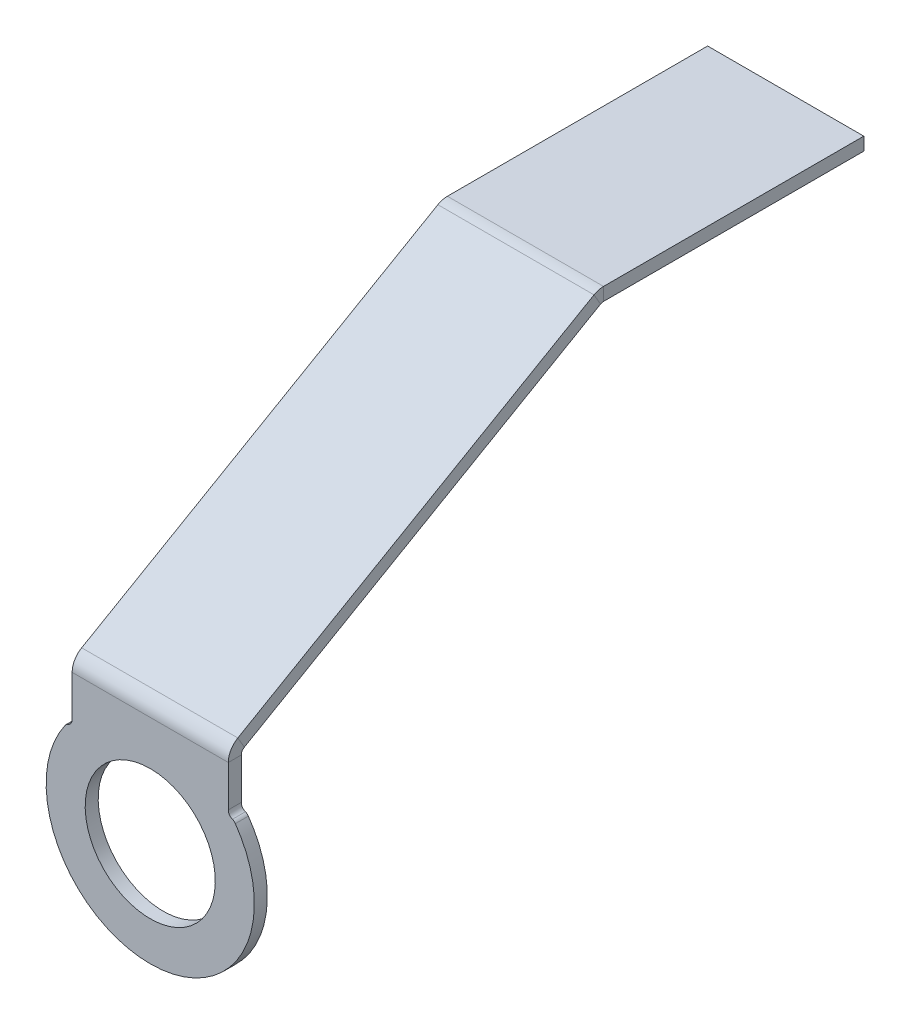
ISO-10303-21;
HEADER;
FILE_DESCRIPTION(('STEP AP214'),'2;1');
FILE_NAME('part.step','',(''),(''),'','','');
FILE_SCHEMA(('AUTOMOTIVE_DESIGN { 1 0 10303 214 1 1 1 1 }'));
ENDSEC;
DATA;
#1=APPLICATION_CONTEXT('core data for automotive mechanical design processes');
#2=APPLICATION_PROTOCOL_DEFINITION('international standard','automotive_design',2000,#1);
#3=PRODUCT_CONTEXT('',#1,'mechanical');
#4=PRODUCT('Part','Part','',(#3));
#5=PRODUCT_RELATED_PRODUCT_CATEGORY('part','',(#4));
#6=PRODUCT_DEFINITION_FORMATION('','',#4);
#7=PRODUCT_DEFINITION_CONTEXT('part definition',#1,'design');
#8=PRODUCT_DEFINITION('design','',#6,#7);
#9=PRODUCT_DEFINITION_SHAPE('','',#8);
#10=(LENGTH_UNIT() NAMED_UNIT(*) SI_UNIT(.MILLI.,.METRE.));
#11=(NAMED_UNIT(*) PLANE_ANGLE_UNIT() SI_UNIT($,.RADIAN.));
#12=(NAMED_UNIT(*) SI_UNIT($,.STERADIAN.) SOLID_ANGLE_UNIT());
#13=UNCERTAINTY_MEASURE_WITH_UNIT(LENGTH_MEASURE(1.E-05),#10,'distance_accuracy_value','');
#14=(GEOMETRIC_REPRESENTATION_CONTEXT(3) GLOBAL_UNCERTAINTY_ASSIGNED_CONTEXT((#13)) GLOBAL_UNIT_ASSIGNED_CONTEXT((#10,
#11,#12)) REPRESENTATION_CONTEXT('',''));
#15=CARTESIAN_POINT('',(0.,0.,0.));
#16=DIRECTION('',(0.,0.,1.));
#17=DIRECTION('',(1.,0.,0.));
#18=AXIS2_PLACEMENT_3D('',#15,#16,#17);
#19=CARTESIAN_POINT('',(9.525,-1.5875,-15.875));
#20=DIRECTION('',(1.,0.,0.));
#21=DIRECTION('',(0.,0.,-1.));
#22=AXIS2_PLACEMENT_3D('',#19,#20,#21);
#23=PLANE('',#22);
#24=DIRECTION('',(0.,0.,-1.));
#25=VECTOR('',#24,1.);
#26=CARTESIAN_POINT('',(9.525,0.,-15.875));
#27=LINE('',#26,#25);
#28=CARTESIAN_POINT('',(9.525,0.,15.875));
#29=VERTEX_POINT('',#28);
#30=CARTESIAN_POINT('',(9.525,0.,-15.875));
#31=VERTEX_POINT('',#30);
#32=EDGE_CURVE('E121',#29,#31,#27,.T.);
#33=ORIENTED_EDGE('',*,*,#32,.F.);
#34=DIRECTION('',(0.,1.,0.));
#35=VECTOR('',#34,1.);
#36=CARTESIAN_POINT('',(9.525,-1.5875,15.875));
#37=LINE('',#36,#35);
#38=CARTESIAN_POINT('',(9.525,-1.5875,15.875));
#39=VERTEX_POINT('',#38);
#40=EDGE_CURVE('E13',#39,#29,#37,.T.);
#41=ORIENTED_EDGE('',*,*,#40,.F.);
#42=DIRECTION('',(0.,0.,-1.));
#43=VECTOR('',#42,1.);
#44=CARTESIAN_POINT('',(9.525,-1.5875,-15.875));
#45=LINE('',#44,#43);
#46=CARTESIAN_POINT('',(9.525,-1.5875,-15.875));
#47=VERTEX_POINT('',#46);
#48=EDGE_CURVE('E142',#39,#47,#45,.T.);
#49=ORIENTED_EDGE('',*,*,#48,.T.);
#50=DIRECTION('',(0.,1.,0.));
#51=VECTOR('',#50,1.);
#52=CARTESIAN_POINT('',(9.525,-1.5875,-15.875));
#53=LINE('',#52,#51);
#54=EDGE_CURVE('E76',#47,#31,#53,.T.);
#55=ORIENTED_EDGE('',*,*,#54,.T.);
#56=EDGE_LOOP('',(#33,#41,#49,#55));
#57=FACE_BOUND('',#56,.T.);
#58=ADVANCED_FACE('F73',(#57),#23,.T.);
#59=CARTESIAN_POINT('',(-9.525,-1.5875,15.875));
#60=DIRECTION('',(-1.,0.,0.));
#61=DIRECTION('',(0.,0.,1.));
#62=AXIS2_PLACEMENT_3D('',#59,#60,#61);
#63=PLANE('',#62);
#64=DIRECTION('',(0.,0.,1.));
#65=VECTOR('',#64,1.);
#66=CARTESIAN_POINT('',(-9.525,0.,15.875));
#67=LINE('',#66,#65);
#68=CARTESIAN_POINT('',(-9.525,0.,-15.875));
#69=VERTEX_POINT('',#68);
#70=CARTESIAN_POINT('',(-9.525,0.,15.875));
#71=VERTEX_POINT('',#70);
#72=EDGE_CURVE('E141',#69,#71,#67,.T.);
#73=ORIENTED_EDGE('',*,*,#72,.F.);
#74=DIRECTION('',(0.,1.,0.));
#75=VECTOR('',#74,1.);
#76=CARTESIAN_POINT('',(-9.525,-1.5875,-15.875));
#77=LINE('',#76,#75);
#78=CARTESIAN_POINT('',(-9.525,-1.5875,-15.875));
#79=VERTEX_POINT('',#78);
#80=EDGE_CURVE('E91',#79,#69,#77,.T.);
#81=ORIENTED_EDGE('',*,*,#80,.F.);
#82=DIRECTION('',(0.,0.,1.));
#83=VECTOR('',#82,1.);
#84=CARTESIAN_POINT('',(-9.525,-1.5875,15.875));
#85=LINE('',#84,#83);
#86=CARTESIAN_POINT('',(-9.525,-1.58750000000001,15.875));
#87=VERTEX_POINT('',#86);
#88=EDGE_CURVE('E152',#79,#87,#85,.T.);
#89=ORIENTED_EDGE('',*,*,#88,.T.);
#90=DIRECTION('',(0.,1.,0.));
#91=VECTOR('',#90,1.);
#92=CARTESIAN_POINT('',(-9.525,-1.5875,15.875));
#93=LINE('',#92,#91);
#94=EDGE_CURVE('E82',#87,#71,#93,.T.);
#95=ORIENTED_EDGE('',*,*,#94,.T.);
#96=EDGE_LOOP('',(#73,#81,#89,#95));
#97=FACE_BOUND('',#96,.T.);
#98=ADVANCED_FACE('F319',(#97),#63,.T.);
#99=CARTESIAN_POINT('',(-9.525,-1.5875,-15.875));
#100=DIRECTION('',(0.,0.,-1.));
#101=DIRECTION('',(-1.,0.,0.));
#102=AXIS2_PLACEMENT_3D('',#99,#100,#101);
#103=PLANE('',#102);
#104=DIRECTION('',(-1.,0.,0.));
#105=VECTOR('',#104,1.);
#106=CARTESIAN_POINT('',(-9.525,0.,-15.875));
#107=LINE('',#106,#105);
#108=EDGE_CURVE('E137',#31,#69,#107,.T.);
#109=ORIENTED_EDGE('',*,*,#108,.F.);
#110=ORIENTED_EDGE('',*,*,#54,.F.);
#111=DIRECTION('',(-1.,0.,0.));
#112=VECTOR('',#111,1.);
#113=CARTESIAN_POINT('',(-9.525,-1.5875,-15.875));
#114=LINE('',#113,#112);
#115=EDGE_CURVE('E144',#47,#79,#114,.T.);
#116=ORIENTED_EDGE('',*,*,#115,.T.);
#117=ORIENTED_EDGE('',*,*,#80,.T.);
#118=EDGE_LOOP('',(#109,#110,#116,#117));
#119=FACE_BOUND('',#118,.T.);
#120=ADVANCED_FACE('F159',(#119),#103,.T.);
#121=CARTESIAN_POINT('',(9.525,-1.5875,15.875));
#122=DIRECTION('',(0.,-1.,0.));
#123=DIRECTION('',(0.,0.,-1.));
#124=AXIS2_PLACEMENT_3D('',#121,#122,#123);
#125=PLANE('',#124);
#126=ORIENTED_EDGE('',*,*,#48,.F.);
#127=DIRECTION('',(1.,0.,0.));
#128=VECTOR('',#127,1.);
#129=CARTESIAN_POINT('',(9.525,-1.5875,15.875));
#130=LINE('',#129,#128);
#131=EDGE_CURVE('E150',#87,#39,#130,.T.);
#132=ORIENTED_EDGE('',*,*,#131,.F.);
#133=ORIENTED_EDGE('',*,*,#88,.F.);
#134=ORIENTED_EDGE('',*,*,#115,.F.);
#135=EDGE_LOOP('',(#126,#132,#133,#134));
#136=FACE_BOUND('',#135,.T.);
#137=ADVANCED_FACE('F162',(#136),#125,.T.);
#138=CARTESIAN_POINT('',(9.525,0.,15.875));
#139=DIRECTION('',(0.,-1.,0.));
#140=DIRECTION('',(0.,0.,-1.));
#141=AXIS2_PLACEMENT_3D('',#138,#139,#140);
#142=PLANE('',#141);
#143=ORIENTED_EDGE('',*,*,#32,.T.);
#144=ORIENTED_EDGE('',*,*,#108,.T.);
#145=ORIENTED_EDGE('',*,*,#72,.T.);
#146=DIRECTION('',(1.,0.,0.));
#147=VECTOR('',#146,1.);
#148=CARTESIAN_POINT('',(9.525,0.,15.875));
#149=LINE('',#148,#147);
#150=EDGE_CURVE('E113',#71,#29,#149,.T.);
#151=ORIENTED_EDGE('',*,*,#150,.T.);
#152=EDGE_LOOP('',(#143,#144,#145,#151));
#153=FACE_BOUND('',#152,.T.);
#154=ADVANCED_FACE('F140',(#153),#142,.F.);
#155=CARTESIAN_POINT('',(9.525,-2.32410000000001,15.875));
#156=DIRECTION('',(1.,0.,0.));
#157=DIRECTION('',(0.,1.,0.));
#158=AXIS2_PLACEMENT_3D('',#155,#156,#157);
#159=PLANE('',#158);
#160=DIRECTION('',(0.,-0.866025403784442,-0.499999999999995));
#161=VECTOR('',#160,1.);
#162=CARTESIAN_POINT('',(9.525,-0.311370359064582,17.03705));
#163=LINE('',#162,#161);
#164=CARTESIAN_POINT('',(9.525,-1.68618568757238,16.2433));
#165=VERTEX_POINT('',#164);
#166=CARTESIAN_POINT('',(9.525,-0.311370359064585,17.03705));
#167=VERTEX_POINT('',#166);
#168=EDGE_CURVE('E169',#165,#167,#163,.F.);
#169=ORIENTED_EDGE('',*,*,#168,.F.);
#170=CARTESIAN_POINT('',(9.525,-2.32410000000001,15.875));
#171=DIRECTION('',(-1.,0.,0.));
#172=DIRECTION('',(0.,-1.,0.));
#173=AXIS2_PLACEMENT_3D('',#170,#171,#172);
#174=CIRCLE('',#173,0.736600000000009);
#175=EDGE_CURVE('E130',#39,#165,#174,.F.);
#176=ORIENTED_EDGE('',*,*,#175,.F.);
#177=ORIENTED_EDGE('',*,*,#40,.T.);
#178=CARTESIAN_POINT('',(9.525,-2.32410000000001,15.875));
#179=DIRECTION('',(-1.,0.,0.));
#180=DIRECTION('',(0.,-1.,0.));
#181=AXIS2_PLACEMENT_3D('',#178,#179,#180);
#182=CIRCLE('',#181,2.32410000000001);
#183=EDGE_CURVE('E109',#29,#167,#182,.F.);
#184=ORIENTED_EDGE('',*,*,#183,.T.);
#185=EDGE_LOOP('',(#169,#176,#177,#184));
#186=FACE_BOUND('',#185,.T.);
#187=ADVANCED_FACE('F127',(#186),#159,.T.);
#188=CARTESIAN_POINT('',(-9.525,-2.32410000000002,15.875));
#189=DIRECTION('',(1.,0.,0.));
#190=DIRECTION('',(0.,1.,0.));
#191=AXIS2_PLACEMENT_3D('',#188,#189,#190);
#192=PLANE('',#191);
#193=CARTESIAN_POINT('',(-9.525,-2.32410000000002,15.875));
#194=DIRECTION('',(-1.,0.,0.));
#195=DIRECTION('',(0.,-1.,0.));
#196=AXIS2_PLACEMENT_3D('',#193,#194,#195);
#197=CIRCLE('',#196,0.736600000000009);
#198=CARTESIAN_POINT('',(-9.525,-1.68618568757239,16.2433));
#199=VERTEX_POINT('',#198);
#200=EDGE_CURVE('E164',#199,#87,#197,.T.);
#201=ORIENTED_EDGE('',*,*,#200,.F.);
#202=DIRECTION('',(0.,-0.866025403784442,-0.499999999999995));
#203=VECTOR('',#202,1.);
#204=CARTESIAN_POINT('',(-9.525,-1.68618568757238,16.2433));
#205=LINE('',#204,#203);
#206=CARTESIAN_POINT('',(-9.525,-0.311370359064582,17.03705));
#207=VERTEX_POINT('',#206);
#208=EDGE_CURVE('E175',#199,#207,#205,.F.);
#209=ORIENTED_EDGE('',*,*,#208,.T.);
#210=CARTESIAN_POINT('',(-9.525,-2.32410000000002,15.875));
#211=DIRECTION('',(-1.,0.,0.));
#212=DIRECTION('',(0.,-1.,0.));
#213=AXIS2_PLACEMENT_3D('',#210,#211,#212);
#214=CIRCLE('',#213,2.32410000000001);
#215=EDGE_CURVE('E122',#207,#71,#214,.T.);
#216=ORIENTED_EDGE('',*,*,#215,.T.);
#217=ORIENTED_EDGE('',*,*,#94,.F.);
#218=EDGE_LOOP('',(#201,#209,#216,#217));
#219=FACE_BOUND('',#218,.T.);
#220=ADVANCED_FACE('F332',(#219),#192,.F.);
#221=CARTESIAN_POINT('',(-9.525,-2.32410000000002,15.875));
#222=DIRECTION('',(-1.,0.,0.));
#223=DIRECTION('',(0.,0.866025403784442,0.499999999999995));
#224=AXIS2_PLACEMENT_3D('',#221,#222,#223);
#225=CYLINDRICAL_SURFACE('',#224,2.32410000000001);
#226=ORIENTED_EDGE('',*,*,#150,.F.);
#227=ORIENTED_EDGE('',*,*,#215,.F.);
#228=DIRECTION('',(-1.,0.,0.));
#229=VECTOR('',#228,1.);
#230=CARTESIAN_POINT('',(9.525,-0.311370359064582,17.03705));
#231=LINE('',#230,#229);
#232=EDGE_CURVE('E117',#207,#167,#231,.F.);
#233=ORIENTED_EDGE('',*,*,#232,.T.);
#234=ORIENTED_EDGE('',*,*,#183,.F.);
#235=EDGE_LOOP('',(#226,#227,#233,#234));
#236=FACE_BOUND('',#235,.T.);
#237=ADVANCED_FACE('F110',(#236),#225,.T.);
#238=CARTESIAN_POINT('',(-9.525,-2.32410000000002,15.875));
#239=DIRECTION('',(-1.,0.,0.));
#240=DIRECTION('',(0.,0.866025403784442,0.499999999999995));
#241=AXIS2_PLACEMENT_3D('',#238,#239,#240);
#242=CYLINDRICAL_SURFACE('',#241,0.736600000000009);
#243=ORIENTED_EDGE('',*,*,#131,.T.);
#244=ORIENTED_EDGE('',*,*,#175,.T.);
#245=DIRECTION('',(-1.,0.,0.));
#246=VECTOR('',#245,1.);
#247=CARTESIAN_POINT('',(9.525,-1.68618568757238,16.2433));
#248=LINE('',#247,#246);
#249=EDGE_CURVE('E171',#165,#199,#248,.T.);
#250=ORIENTED_EDGE('',*,*,#249,.T.);
#251=ORIENTED_EDGE('',*,*,#200,.T.);
#252=EDGE_LOOP('',(#243,#244,#250,#251));
#253=FACE_BOUND('',#252,.T.);
#254=ADVANCED_FACE('F336',(#253),#242,.F.);
#255=CARTESIAN_POINT('',(-9.525,-25.3999999999997,60.4918312303788));
#256=DIRECTION('',(1.,0.,0.));
#257=DIRECTION('',(0.,0.,-1.));
#258=AXIS2_PLACEMENT_3D('',#255,#256,#257);
#259=PLANE('',#258);
#260=ORIENTED_EDGE('',*,*,#208,.F.);
#261=DIRECTION('',(0.,0.499999999999995,-0.866025403784442));
#262=VECTOR('',#261,1.);
#263=CARTESIAN_POINT('',(-9.525,-26.7748153285075,59.6980812303788));
#264=LINE('',#263,#262);
#265=CARTESIAN_POINT('',(-9.525,-26.7748153285075,59.6980812303788));
#266=VERTEX_POINT('',#265);
#267=EDGE_CURVE('E179',#199,#266,#264,.F.);
#268=ORIENTED_EDGE('',*,*,#267,.T.);
#269=DIRECTION('',(0.,-0.866025403784442,-0.499999999999995));
#270=VECTOR('',#269,1.);
#271=CARTESIAN_POINT('',(-9.525,-25.3999999999997,60.4918312303788));
#272=LINE('',#271,#270);
#273=CARTESIAN_POINT('',(-9.525,-25.3999999999997,60.4918312303788));
#274=VERTEX_POINT('',#273);
#275=EDGE_CURVE('E166',#274,#266,#272,.T.);
#276=ORIENTED_EDGE('',*,*,#275,.F.);
#277=DIRECTION('',(0.,-0.499999999999995,0.866025403784442));
#278=VECTOR('',#277,1.);
#279=CARTESIAN_POINT('',(-9.525,-0.2126846714922,16.8661213751448));
#280=LINE('',#279,#278);
#281=EDGE_CURVE('E188',#207,#274,#280,.T.);
#282=ORIENTED_EDGE('',*,*,#281,.F.);
#283=EDGE_LOOP('',(#260,#268,#276,#282));
#284=FACE_BOUND('',#283,.T.);
#285=ADVANCED_FACE('F341',(#284),#259,.F.);
#286=CARTESIAN_POINT('',(9.525,-0.2126846714922,16.8661213751448));
#287=DIRECTION('',(-1.,0.,0.));
#288=DIRECTION('',(0.,0.,1.));
#289=AXIS2_PLACEMENT_3D('',#286,#287,#288);
#290=PLANE('',#289);
#291=ORIENTED_EDGE('',*,*,#168,.T.);
#292=DIRECTION('',(0.,0.499999999999995,-0.866025403784442));
#293=VECTOR('',#292,1.);
#294=CARTESIAN_POINT('',(9.525,-0.2126846714922,16.8661213751448));
#295=LINE('',#294,#293);
#296=CARTESIAN_POINT('',(9.525,-25.3999999999997,60.4918312303788));
#297=VERTEX_POINT('',#296);
#298=EDGE_CURVE('E194',#297,#167,#295,.T.);
#299=ORIENTED_EDGE('',*,*,#298,.F.);
#300=DIRECTION('',(0.,-0.866025403784442,-0.499999999999995));
#301=VECTOR('',#300,1.);
#302=CARTESIAN_POINT('',(9.525,-25.3999999999997,60.4918312303788));
#303=LINE('',#302,#301);
#304=CARTESIAN_POINT('',(9.525,-26.7748153285075,59.6980812303788));
#305=VERTEX_POINT('',#304);
#306=EDGE_CURVE('E197',#297,#305,#303,.T.);
#307=ORIENTED_EDGE('',*,*,#306,.T.);
#308=DIRECTION('',(0.,-0.499999999999995,0.866025403784442));
#309=VECTOR('',#308,1.);
#310=CARTESIAN_POINT('',(9.525,-1.5875,16.0723713751448));
#311=LINE('',#310,#309);
#312=EDGE_CURVE('E185',#305,#165,#311,.F.);
#313=ORIENTED_EDGE('',*,*,#312,.T.);
#314=EDGE_LOOP('',(#291,#299,#307,#313));
#315=FACE_BOUND('',#314,.T.);
#316=ADVANCED_FACE('F346',(#315),#290,.F.);
#317=CARTESIAN_POINT('',(-9.525,-0.2126846714922,16.8661213751448));
#318=DIRECTION('',(0.,-0.866025403784442,-0.499999999999995));
#319=DIRECTION('',(0.,0.499999999999995,-0.866025403784442));
#320=AXIS2_PLACEMENT_3D('',#317,#318,#319);
#321=PLANE('',#320);
#322=ORIENTED_EDGE('',*,*,#232,.F.);
#323=ORIENTED_EDGE('',*,*,#281,.T.);
#324=DIRECTION('',(1.,0.,0.));
#325=VECTOR('',#324,1.);
#326=CARTESIAN_POINT('',(-9.525,-25.3999999999997,60.4918312303788));
#327=LINE('',#326,#325);
#328=EDGE_CURVE('E191',#274,#297,#327,.T.);
#329=ORIENTED_EDGE('',*,*,#328,.T.);
#330=ORIENTED_EDGE('',*,*,#298,.T.);
#331=EDGE_LOOP('',(#322,#323,#329,#330));
#332=FACE_BOUND('',#331,.T.);
#333=ADVANCED_FACE('F350',(#332),#321,.F.);
#334=CARTESIAN_POINT('',(-9.525,-1.5875,16.0723713751448));
#335=DIRECTION('',(0.,-0.866025403784442,-0.499999999999995));
#336=DIRECTION('',(0.,0.499999999999995,-0.866025403784442));
#337=AXIS2_PLACEMENT_3D('',#334,#335,#336);
#338=PLANE('',#337);
#339=ORIENTED_EDGE('',*,*,#267,.F.);
#340=ORIENTED_EDGE('',*,*,#249,.F.);
#341=ORIENTED_EDGE('',*,*,#312,.F.);
#342=DIRECTION('',(-1.,0.,0.));
#343=VECTOR('',#342,1.);
#344=CARTESIAN_POINT('',(9.525,-26.7748153285075,59.6980812303788));
#345=LINE('',#344,#343);
#346=EDGE_CURVE('E182',#266,#305,#345,.F.);
#347=ORIENTED_EDGE('',*,*,#346,.F.);
#348=EDGE_LOOP('',(#339,#340,#341,#347));
#349=FACE_BOUND('',#348,.T.);
#350=ADVANCED_FACE('F352',(#349),#338,.T.);
#351=CARTESIAN_POINT('',(9.525,-27.4127296409351,59.3297812303788));
#352=DIRECTION('',(1.,0.,0.));
#353=DIRECTION('',(0.,0.,-1.));
#354=AXIS2_PLACEMENT_3D('',#351,#352,#353);
#355=PLANE('',#354);
#356=DIRECTION('',(0.,0.,1.));
#357=VECTOR('',#356,1.);
#358=CARTESIAN_POINT('',(9.525,-27.4127296409351,61.6538812303789));
#359=LINE('',#358,#357);
#360=CARTESIAN_POINT('',(9.525,-27.4127296409351,60.0663812303788));
#361=VERTEX_POINT('',#360);
#362=CARTESIAN_POINT('',(9.525,-27.4127296409351,61.6538812303788));
#363=VERTEX_POINT('',#362);
#364=EDGE_CURVE('E214',#361,#363,#359,.T.);
#365=ORIENTED_EDGE('',*,*,#364,.F.);
#366=CARTESIAN_POINT('',(9.525,-27.4127296409351,59.3297812303788));
#367=DIRECTION('',(-1.,0.,0.));
#368=DIRECTION('',(0.,0.,1.));
#369=AXIS2_PLACEMENT_3D('',#366,#367,#368);
#370=CIRCLE('',#369,0.736599999999997);
#371=EDGE_CURVE('E205',#305,#361,#370,.F.);
#372=ORIENTED_EDGE('',*,*,#371,.F.);
#373=ORIENTED_EDGE('',*,*,#306,.F.);
#374=CARTESIAN_POINT('',(9.525,-27.4127296409351,59.3297812303788));
#375=DIRECTION('',(-1.,0.,0.));
#376=DIRECTION('',(0.,0.,1.));
#377=AXIS2_PLACEMENT_3D('',#374,#375,#376);
#378=CIRCLE('',#377,2.3241);
#379=EDGE_CURVE('E172',#297,#363,#378,.F.);
#380=ORIENTED_EDGE('',*,*,#379,.T.);
#381=EDGE_LOOP('',(#365,#372,#373,#380));
#382=FACE_BOUND('',#381,.T.);
#383=ADVANCED_FACE('F355',(#382),#355,.T.);
#384=CARTESIAN_POINT('',(-9.525,-27.4127296409351,59.3297812303788));
#385=DIRECTION('',(1.,0.,0.));
#386=DIRECTION('',(0.,0.,-1.));
#387=AXIS2_PLACEMENT_3D('',#384,#385,#386);
#388=PLANE('',#387);
#389=CARTESIAN_POINT('',(-9.525,-27.4127296409351,59.3297812303788));
#390=DIRECTION('',(-1.,0.,0.));
#391=DIRECTION('',(0.,0.,1.));
#392=AXIS2_PLACEMENT_3D('',#389,#390,#391);
#393=CIRCLE('',#392,0.736599999999997);
#394=CARTESIAN_POINT('',(-9.525,-27.4127296409351,60.0663812303788));
#395=VERTEX_POINT('',#394);
#396=EDGE_CURVE('E202',#395,#266,#393,.T.);
#397=ORIENTED_EDGE('',*,*,#396,.F.);
#398=DIRECTION('',(0.,0.,1.));
#399=VECTOR('',#398,1.);
#400=CARTESIAN_POINT('',(-9.525,-27.4127296409351,60.0663812303788));
#401=LINE('',#400,#399);
#402=CARTESIAN_POINT('',(-9.525,-27.4127296409351,61.6538812303788));
#403=VERTEX_POINT('',#402);
#404=EDGE_CURVE('E221',#395,#403,#401,.T.);
#405=ORIENTED_EDGE('',*,*,#404,.T.);
#406=CARTESIAN_POINT('',(-9.525,-27.4127296409351,59.3297812303788));
#407=DIRECTION('',(-1.,0.,0.));
#408=DIRECTION('',(0.,0.,1.));
#409=AXIS2_PLACEMENT_3D('',#406,#407,#408);
#410=CIRCLE('',#409,2.3241);
#411=EDGE_CURVE('E209',#403,#274,#410,.T.);
#412=ORIENTED_EDGE('',*,*,#411,.T.);
#413=ORIENTED_EDGE('',*,*,#275,.T.);
#414=EDGE_LOOP('',(#397,#405,#412,#413));
#415=FACE_BOUND('',#414,.T.);
#416=ADVANCED_FACE('F360',(#415),#388,.F.);
#417=CARTESIAN_POINT('',(-9.525,-27.4127296409351,59.3297812303788));
#418=DIRECTION('',(-1.,0.,0.));
#419=DIRECTION('',(0.,0.,1.));
#420=AXIS2_PLACEMENT_3D('',#417,#418,#419);
#421=CYLINDRICAL_SURFACE('',#420,2.3241);
#422=ORIENTED_EDGE('',*,*,#328,.F.);
#423=ORIENTED_EDGE('',*,*,#411,.F.);
#424=DIRECTION('',(-1.,0.,0.));
#425=VECTOR('',#424,1.);
#426=CARTESIAN_POINT('',(-9.525,-27.4127296409351,61.6538812303788));
#427=LINE('',#426,#425);
#428=EDGE_CURVE('E224',#363,#403,#427,.T.);
#429=ORIENTED_EDGE('',*,*,#428,.F.);
#430=ORIENTED_EDGE('',*,*,#379,.F.);
#431=EDGE_LOOP('',(#422,#423,#429,#430));
#432=FACE_BOUND('',#431,.T.);
#433=ADVANCED_FACE('F363',(#432),#421,.T.);
#434=CARTESIAN_POINT('',(-9.525,-27.4127296409351,59.3297812303788));
#435=DIRECTION('',(-1.,0.,0.));
#436=DIRECTION('',(0.,0.,1.));
#437=AXIS2_PLACEMENT_3D('',#434,#435,#436);
#438=CYLINDRICAL_SURFACE('',#437,0.736599999999997);
#439=ORIENTED_EDGE('',*,*,#346,.T.);
#440=ORIENTED_EDGE('',*,*,#371,.T.);
#441=DIRECTION('',(1.,0.,0.));
#442=VECTOR('',#441,1.);
#443=CARTESIAN_POINT('',(9.525,-27.4127296409351,60.0663812303788));
#444=LINE('',#443,#442);
#445=EDGE_CURVE('E217',#361,#395,#444,.F.);
#446=ORIENTED_EDGE('',*,*,#445,.T.);
#447=ORIENTED_EDGE('',*,*,#396,.T.);
#448=EDGE_LOOP('',(#439,#440,#446,#447));
#449=FACE_BOUND('',#448,.T.);
#450=ADVANCED_FACE('F365',(#449),#438,.F.);
#451=CARTESIAN_POINT('',(-9.525,-26.9874534326501,61.6538812303788));
#452=DIRECTION('',(-1.,0.,0.));
#453=DIRECTION('',(0.,-1.,0.));
#454=AXIS2_PLACEMENT_3D('',#451,#452,#453);
#455=PLANE('',#454);
#456=DIRECTION('',(0.,1.,0.));
#457=VECTOR('',#456,1.);
#458=CARTESIAN_POINT('',(-9.525,-26.9874534326501,61.6538812303788));
#459=LINE('',#458,#457);
#460=CARTESIAN_POINT('',(-9.525,-32.4209098803115,61.6538812303789));
#461=VERTEX_POINT('',#460);
#462=EDGE_CURVE('E236',#461,#403,#459,.T.);
#463=ORIENTED_EDGE('',*,*,#462,.T.);
#464=ORIENTED_EDGE('',*,*,#404,.F.);
#465=DIRECTION('',(0.,-1.,0.));
#466=VECTOR('',#465,1.);
#467=CARTESIAN_POINT('',(-9.525,-26.9874534326501,60.0663812303788));
#468=LINE('',#467,#466);
#469=CARTESIAN_POINT('',(-9.525,-32.4209098803115,60.0663812303789));
#470=VERTEX_POINT('',#469);
#471=EDGE_CURVE('E230',#470,#395,#468,.F.);
#472=ORIENTED_EDGE('',*,*,#471,.F.);
#473=DIRECTION('',(0.,0.,-1.));
#474=VECTOR('',#473,1.);
#475=CARTESIAN_POINT('',(-9.525,-32.4209098803115,61.6538812303789));
#476=LINE('',#475,#474);
#477=EDGE_CURVE('E206',#461,#470,#476,.T.);
#478=ORIENTED_EDGE('',*,*,#477,.F.);
#479=EDGE_LOOP('',(#463,#464,#472,#478));
#480=FACE_BOUND('',#479,.T.);
#481=ADVANCED_FACE('F371',(#480),#455,.T.);
#482=CARTESIAN_POINT('',(9.52499999999999,-32.4209098803115,61.6538812303789));
#483=DIRECTION('',(1.,0.,0.));
#484=DIRECTION('',(0.,1.,0.));
#485=AXIS2_PLACEMENT_3D('',#482,#483,#484);
#486=PLANE('',#485);
#487=DIRECTION('',(0.,1.,0.));
#488=VECTOR('',#487,1.);
#489=CARTESIAN_POINT('',(9.525,-26.9874534326501,60.0663812303788));
#490=LINE('',#489,#488);
#491=CARTESIAN_POINT('',(9.52499999999999,-32.4209098803116,60.0663812303789));
#492=VERTEX_POINT('',#491);
#493=EDGE_CURVE('E227',#361,#492,#490,.F.);
#494=ORIENTED_EDGE('',*,*,#493,.F.);
#495=ORIENTED_EDGE('',*,*,#364,.T.);
#496=DIRECTION('',(0.,-1.,0.));
#497=VECTOR('',#496,1.);
#498=CARTESIAN_POINT('',(9.52499999999999,-32.4209098803115,61.6538812303789));
#499=LINE('',#498,#497);
#500=CARTESIAN_POINT('',(9.52499999999999,-32.4209098803115,61.6538812303789));
#501=VERTEX_POINT('',#500);
#502=EDGE_CURVE('E233',#363,#501,#499,.T.);
#503=ORIENTED_EDGE('',*,*,#502,.T.);
#504=DIRECTION('',(0.,0.,-1.));
#505=VECTOR('',#504,1.);
#506=CARTESIAN_POINT('',(9.52499999999999,-32.4209098803115,61.6538812303789));
#507=LINE('',#506,#505);
#508=EDGE_CURVE('E239',#501,#492,#507,.T.);
#509=ORIENTED_EDGE('',*,*,#508,.T.);
#510=EDGE_LOOP('',(#494,#495,#503,#509));
#511=FACE_BOUND('',#510,.T.);
#512=ADVANCED_FACE('F313',(#511),#486,.T.);
#513=CARTESIAN_POINT('',(-9.525,-26.9874534326501,61.6538812303788));
#514=DIRECTION('',(0.,0.,1.));
#515=DIRECTION('',(0.,-1.,0.));
#516=AXIS2_PLACEMENT_3D('',#513,#514,#515);
#517=PLANE('',#516);
#518=ORIENTED_EDGE('',*,*,#502,.F.);
#519=ORIENTED_EDGE('',*,*,#428,.T.);
#520=ORIENTED_EDGE('',*,*,#462,.F.);
#521=CARTESIAN_POINT('',(-10.31875,-32.4209098803115,61.6538812303789));
#522=DIRECTION('',(0.,0.,1.));
#523=DIRECTION('',(0.,1.,0.));
#524=AXIS2_PLACEMENT_3D('',#521,#522,#523);
#525=CIRCLE('',#524,0.79375);
#526=CARTESIAN_POINT('',(-10.0271452640054,-33.1591549212333,61.6538812303789));
#527=VERTEX_POINT('',#526);
#528=EDGE_CURVE('E275',#527,#461,#525,.T.);
#529=ORIENTED_EDGE('',*,*,#528,.F.);
#530=CARTESIAN_POINT('',(-9.73554052801086,-33.897399962155,61.6538812303789));
#531=DIRECTION('',(0.,0.,-1.));
#532=DIRECTION('',(0.,-1.,0.));
#533=AXIS2_PLACEMENT_3D('',#530,#531,#532);
#534=CIRCLE('',#533,0.793749999999999);
#535=CARTESIAN_POINT('',(-10.3845765632116,-33.4404631092848,61.6538812303789));
#536=VERTEX_POINT('',#535);
#537=EDGE_CURVE('E278',#536,#527,#534,.T.);
#538=ORIENTED_EDGE('',*,*,#537,.F.);
#539=CARTESIAN_POINT('',(0.,-40.7514527552081,61.6538812303789));
#540=DIRECTION('',(0.,0.,-1.));
#541=DIRECTION('',(0.,-1.,0.));
#542=AXIS2_PLACEMENT_3D('',#539,#540,#541);
#543=CIRCLE('',#542,12.7);
#544=CARTESIAN_POINT('',(10.3845765632116,-33.4404631092848,61.6538812303789));
#545=VERTEX_POINT('',#544);
#546=EDGE_CURVE('E281',#545,#536,#543,.T.);
#547=ORIENTED_EDGE('',*,*,#546,.F.);
#548=CARTESIAN_POINT('',(9.73554052801085,-33.897399962155,61.6538812303789));
#549=DIRECTION('',(0.,0.,-1.));
#550=DIRECTION('',(0.,1.,0.));
#551=AXIS2_PLACEMENT_3D('',#548,#549,#550);
#552=CIRCLE('',#551,0.793749999999999);
#553=CARTESIAN_POINT('',(10.0271452640054,-33.1591549212333,61.6538812303789));
#554=VERTEX_POINT('',#553);
#555=EDGE_CURVE('E259',#554,#545,#552,.T.);
#556=ORIENTED_EDGE('',*,*,#555,.F.);
#557=CARTESIAN_POINT('',(10.31875,-32.4209098803115,61.6538812303789));
#558=DIRECTION('',(0.,0.,1.));
#559=DIRECTION('',(0.,-1.,0.));
#560=AXIS2_PLACEMENT_3D('',#557,#558,#559);
#561=CIRCLE('',#560,0.79375);
#562=EDGE_CURVE('E248',#501,#554,#561,.T.);
#563=ORIENTED_EDGE('',*,*,#562,.F.);
#564=EDGE_LOOP('',(#518,#519,#520,#529,#538,#547,#556,#563));
#565=FACE_BOUND('',#564,.T.);
#566=CARTESIAN_POINT('',(0.,-40.7514527552081,61.6538812303789));
#567=DIRECTION('',(0.,0.,-1.));
#568=DIRECTION('',(0.,1.,0.));
#569=AXIS2_PLACEMENT_3D('',#566,#567,#568);
#570=CIRCLE('',#569,7.9375);
#571=CARTESIAN_POINT('',(0.,-32.8139527552081,61.6538812303789));
#572=VERTEX_POINT('',#571);
#573=EDGE_CURVE('E272',#572,#572,#570,.T.);
#574=ORIENTED_EDGE('',*,*,#573,.T.);
#575=EDGE_LOOP('',(#574));
#576=FACE_BOUND('',#575,.T.);
#577=ADVANCED_FACE('F292',(#565,#576),#517,.T.);
#578=CARTESIAN_POINT('',(-9.525,-26.9874534326501,60.0663812303788));
#579=DIRECTION('',(0.,0.,1.));
#580=DIRECTION('',(0.,-1.,0.));
#581=AXIS2_PLACEMENT_3D('',#578,#579,#580);
#582=PLANE('',#581);
#583=ORIENTED_EDGE('',*,*,#445,.F.);
#584=ORIENTED_EDGE('',*,*,#493,.T.);
#585=CARTESIAN_POINT('',(10.31875,-32.4209098803116,60.0663812303789));
#586=DIRECTION('',(0.,0.,1.));
#587=DIRECTION('',(0.,-1.,0.));
#588=AXIS2_PLACEMENT_3D('',#585,#586,#587);
#589=CIRCLE('',#588,0.79375);
#590=CARTESIAN_POINT('',(10.0271452640054,-33.1591549212333,60.0663812303789));
#591=VERTEX_POINT('',#590);
#592=EDGE_CURVE('E256',#492,#591,#589,.T.);
#593=ORIENTED_EDGE('',*,*,#592,.T.);
#594=CARTESIAN_POINT('',(9.73554052801085,-33.897399962155,60.0663812303789));
#595=DIRECTION('',(0.,0.,-1.));
#596=DIRECTION('',(0.,1.,0.));
#597=AXIS2_PLACEMENT_3D('',#594,#595,#596);
#598=CIRCLE('',#597,0.793749999999999);
#599=CARTESIAN_POINT('',(10.3845765632116,-33.4404631092848,60.0663812303789));
#600=VERTEX_POINT('',#599);
#601=EDGE_CURVE('E269',#591,#600,#598,.T.);
#602=ORIENTED_EDGE('',*,*,#601,.T.);
#603=CARTESIAN_POINT('',(0.,-40.7514527552081,60.066381230379));
#604=DIRECTION('',(0.,0.,-1.));
#605=DIRECTION('',(0.,-1.,0.));
#606=AXIS2_PLACEMENT_3D('',#603,#604,#605);
#607=CIRCLE('',#606,12.7);
#608=CARTESIAN_POINT('',(-10.3845765632116,-33.4404631092848,60.0663812303789));
#609=VERTEX_POINT('',#608);
#610=EDGE_CURVE('E266',#600,#609,#607,.T.);
#611=ORIENTED_EDGE('',*,*,#610,.T.);
#612=CARTESIAN_POINT('',(-9.73554052801086,-33.897399962155,60.0663812303789));
#613=DIRECTION('',(0.,0.,-1.));
#614=DIRECTION('',(0.,-1.,0.));
#615=AXIS2_PLACEMENT_3D('',#612,#613,#614);
#616=CIRCLE('',#615,0.793749999999999);
#617=CARTESIAN_POINT('',(-10.0271452640054,-33.1591549212333,60.0663812303789));
#618=VERTEX_POINT('',#617);
#619=EDGE_CURVE('E263',#609,#618,#616,.T.);
#620=ORIENTED_EDGE('',*,*,#619,.T.);
#621=CARTESIAN_POINT('',(-10.31875,-32.4209098803116,60.0663812303789));
#622=DIRECTION('',(0.,0.,1.));
#623=DIRECTION('',(0.,1.,0.));
#624=AXIS2_PLACEMENT_3D('',#621,#622,#623);
#625=CIRCLE('',#624,0.79375);
#626=EDGE_CURVE('E260',#618,#470,#625,.T.);
#627=ORIENTED_EDGE('',*,*,#626,.T.);
#628=ORIENTED_EDGE('',*,*,#471,.T.);
#629=EDGE_LOOP('',(#583,#584,#593,#602,#611,#620,#627,#628));
#630=FACE_BOUND('',#629,.T.);
#631=CARTESIAN_POINT('',(0.,-40.7514527552081,60.066381230379));
#632=DIRECTION('',(0.,0.,-1.));
#633=DIRECTION('',(0.,1.,0.));
#634=AXIS2_PLACEMENT_3D('',#631,#632,#633);
#635=CIRCLE('',#634,7.9375);
#636=CARTESIAN_POINT('',(0.,-32.8139527552081,60.0663812303789));
#637=VERTEX_POINT('',#636);
#638=EDGE_CURVE('E286',#637,#637,#635,.T.);
#639=ORIENTED_EDGE('',*,*,#638,.F.);
#640=EDGE_LOOP('',(#639));
#641=FACE_BOUND('',#640,.T.);
#642=ADVANCED_FACE('F301',(#630,#641),#582,.F.);
#643=CARTESIAN_POINT('',(9.73554052801085,-33.897399962155,61.6538812303789));
#644=DIRECTION('',(0.,0.,-1.));
#645=DIRECTION('',(0.,1.,0.));
#646=AXIS2_PLACEMENT_3D('',#643,#644,#645);
#647=CYLINDRICAL_SURFACE('',#646,0.793749999999999);
#648=ORIENTED_EDGE('',*,*,#601,.F.);
#649=DIRECTION('',(0.,0.,-1.));
#650=VECTOR('',#649,1.);
#651=CARTESIAN_POINT('',(10.0271452640054,-33.1591549212333,61.6538812303789));
#652=LINE('',#651,#650);
#653=EDGE_CURVE('E218',#554,#591,#652,.T.);
#654=ORIENTED_EDGE('',*,*,#653,.F.);
#655=ORIENTED_EDGE('',*,*,#555,.T.);
#656=DIRECTION('',(0.,0.,-1.));
#657=VECTOR('',#656,1.);
#658=CARTESIAN_POINT('',(10.3845765632116,-33.4404631092848,61.6538812303789));
#659=LINE('',#658,#657);
#660=EDGE_CURVE('E244',#545,#600,#659,.T.);
#661=ORIENTED_EDGE('',*,*,#660,.T.);
#662=EDGE_LOOP('',(#648,#654,#655,#661));
#663=FACE_BOUND('',#662,.T.);
#664=ADVANCED_FACE('F303',(#663),#647,.T.);
#665=CARTESIAN_POINT('',(10.31875,-32.4209098803115,61.6538812303789));
#666=DIRECTION('',(0.,0.,-1.));
#667=DIRECTION('',(0.,1.,0.));
#668=AXIS2_PLACEMENT_3D('',#665,#666,#667);
#669=CYLINDRICAL_SURFACE('',#668,0.79375);
#670=ORIENTED_EDGE('',*,*,#592,.F.);
#671=ORIENTED_EDGE('',*,*,#508,.F.);
#672=ORIENTED_EDGE('',*,*,#562,.T.);
#673=ORIENTED_EDGE('',*,*,#653,.T.);
#674=EDGE_LOOP('',(#670,#671,#672,#673));
#675=FACE_BOUND('',#674,.T.);
#676=ADVANCED_FACE('F310',(#675),#669,.F.);
#677=CARTESIAN_POINT('',(-10.31875,-32.4209098803115,61.6538812303789));
#678=DIRECTION('',(0.,0.,-1.));
#679=DIRECTION('',(0.,1.,0.));
#680=AXIS2_PLACEMENT_3D('',#677,#678,#679);
#681=CYLINDRICAL_SURFACE('',#680,0.79375);
#682=ORIENTED_EDGE('',*,*,#626,.F.);
#683=DIRECTION('',(0.,0.,-1.));
#684=VECTOR('',#683,1.);
#685=CARTESIAN_POINT('',(-10.0271452640054,-33.1591549212333,61.6538812303789));
#686=LINE('',#685,#684);
#687=EDGE_CURVE('E251',#527,#618,#686,.T.);
#688=ORIENTED_EDGE('',*,*,#687,.F.);
#689=ORIENTED_EDGE('',*,*,#528,.T.);
#690=ORIENTED_EDGE('',*,*,#477,.T.);
#691=EDGE_LOOP('',(#682,#688,#689,#690));
#692=FACE_BOUND('',#691,.T.);
#693=ADVANCED_FACE('F402',(#692),#681,.F.);
#694=CARTESIAN_POINT('',(-9.73554052801086,-33.897399962155,61.6538812303789));
#695=DIRECTION('',(0.,0.,-1.));
#696=DIRECTION('',(0.,1.,0.));
#697=AXIS2_PLACEMENT_3D('',#694,#695,#696);
#698=CYLINDRICAL_SURFACE('',#697,0.793749999999999);
#699=ORIENTED_EDGE('',*,*,#619,.F.);
#700=DIRECTION('',(0.,0.,-1.));
#701=VECTOR('',#700,1.);
#702=CARTESIAN_POINT('',(-10.3845765632116,-33.4404631092848,61.6538812303789));
#703=LINE('',#702,#701);
#704=EDGE_CURVE('E247',#536,#609,#703,.T.);
#705=ORIENTED_EDGE('',*,*,#704,.F.);
#706=ORIENTED_EDGE('',*,*,#537,.T.);
#707=ORIENTED_EDGE('',*,*,#687,.T.);
#708=EDGE_LOOP('',(#699,#705,#706,#707));
#709=FACE_BOUND('',#708,.T.);
#710=ADVANCED_FACE('F410',(#709),#698,.T.);
#711=CARTESIAN_POINT('',(0.,-40.7514527552081,61.6538812303789));
#712=DIRECTION('',(0.,0.,-1.));
#713=DIRECTION('',(0.,1.,0.));
#714=AXIS2_PLACEMENT_3D('',#711,#712,#713);
#715=CYLINDRICAL_SURFACE('',#714,12.7);
#716=ORIENTED_EDGE('',*,*,#610,.F.);
#717=ORIENTED_EDGE('',*,*,#660,.F.);
#718=ORIENTED_EDGE('',*,*,#546,.T.);
#719=ORIENTED_EDGE('',*,*,#704,.T.);
#720=EDGE_LOOP('',(#716,#717,#718,#719));
#721=FACE_BOUND('',#720,.T.);
#722=ADVANCED_FACE('F297',(#721),#715,.T.);
#723=CARTESIAN_POINT('',(0.,-40.7514527552081,61.6538812303789));
#724=DIRECTION('',(0.,0.,-1.));
#725=DIRECTION('',(0.,1.,0.));
#726=AXIS2_PLACEMENT_3D('',#723,#724,#725);
#727=CYLINDRICAL_SURFACE('',#726,7.9375);
#728=ORIENTED_EDGE('',*,*,#573,.F.);
#729=EDGE_LOOP('',(#728));
#730=FACE_BOUND('',#729,.T.);
#731=ORIENTED_EDGE('',*,*,#638,.T.);
#732=EDGE_LOOP('',(#731));
#733=FACE_BOUND('',#732,.T.);
#734=ADVANCED_FACE('F294',(#730,#733),#727,.F.);
#735=CLOSED_SHELL('',(#58,#98,#120,#137,#154,#187,#220,#237,#254,#285,#316,#333,#350,#383,#416,
#433,#450,#481,#512,#577,#642,#664,#676,#693,#710,#722,#734));
#736=MANIFOLD_SOLID_BREP('B2',#735);
#737=ADVANCED_BREP_SHAPE_REPRESENTATION('',(#18,#736),#14);
#738=SHAPE_DEFINITION_REPRESENTATION(#9,#737);
ENDSEC;
END-ISO-10303-21;
